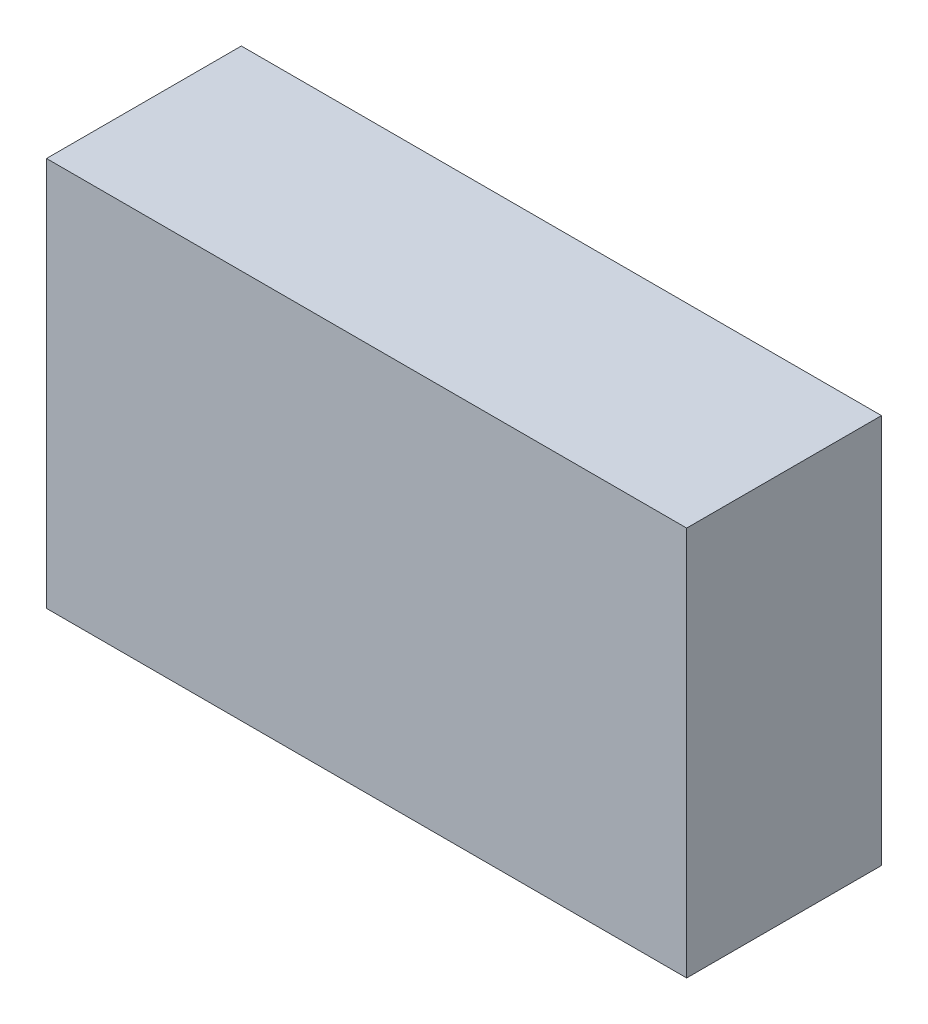
ISO-10303-21;
HEADER;
FILE_DESCRIPTION(('STEP AP214'),'2;1');
FILE_NAME('part.step','',(''),(''),'','','');
FILE_SCHEMA(('AUTOMOTIVE_DESIGN { 1 0 10303 214 1 1 1 1 }'));
ENDSEC;
DATA;
#1=APPLICATION_CONTEXT('core data for automotive mechanical design processes');
#2=APPLICATION_PROTOCOL_DEFINITION('international standard','automotive_design',2000,#1);
#3=PRODUCT_CONTEXT('',#1,'mechanical');
#4=PRODUCT('Part','Part','',(#3));
#5=PRODUCT_RELATED_PRODUCT_CATEGORY('part','',(#4));
#6=PRODUCT_DEFINITION_FORMATION('','',#4);
#7=PRODUCT_DEFINITION_CONTEXT('part definition',#1,'design');
#8=PRODUCT_DEFINITION('design','',#6,#7);
#9=PRODUCT_DEFINITION_SHAPE('','',#8);
#10=(LENGTH_UNIT() NAMED_UNIT(*) SI_UNIT(.MILLI.,.METRE.));
#11=(NAMED_UNIT(*) PLANE_ANGLE_UNIT() SI_UNIT($,.RADIAN.));
#12=(NAMED_UNIT(*) SI_UNIT($,.STERADIAN.) SOLID_ANGLE_UNIT());
#13=UNCERTAINTY_MEASURE_WITH_UNIT(LENGTH_MEASURE(1.E-05),#10,'distance_accuracy_value','');
#14=(GEOMETRIC_REPRESENTATION_CONTEXT(3) GLOBAL_UNCERTAINTY_ASSIGNED_CONTEXT((#13)) GLOBAL_UNIT_ASSIGNED_CONTEXT((#10,
#11,#12)) REPRESENTATION_CONTEXT('',''));
#15=CARTESIAN_POINT('',(0.,0.,0.));
#16=DIRECTION('',(0.,0.,1.));
#17=DIRECTION('',(1.,0.,0.));
#18=AXIS2_PLACEMENT_3D('',#15,#16,#17);
#19=CARTESIAN_POINT('',(-2.30000048,1.39999974,1.39999974));
#20=DIRECTION('',(0.,0.,-1.));
#21=DIRECTION('',(-1.,0.,0.));
#22=AXIS2_PLACEMENT_3D('',#19,#20,#21);
#23=PLANE('',#22);
#24=DIRECTION('',(1.,0.,0.));
#25=VECTOR('',#24,1.);
#26=CARTESIAN_POINT('',(-2.30000048,-1.39999974,1.39999974));
#27=LINE('',#26,#25);
#28=CARTESIAN_POINT('',(-2.30000048,-1.39999974,1.39999974));
#29=VERTEX_POINT('',#28);
#30=CARTESIAN_POINT('',(2.30000048,-1.39999974,1.39999974));
#31=VERTEX_POINT('',#30);
#32=EDGE_CURVE('E54',#29,#31,#27,.T.);
#33=ORIENTED_EDGE('',*,*,#32,.T.);
#34=DIRECTION('',(0.,1.,0.));
#35=VECTOR('',#34,1.);
#36=CARTESIAN_POINT('',(2.30000048,-1.39999974,1.39999974));
#37=LINE('',#36,#35);
#38=CARTESIAN_POINT('',(2.30000048,1.39999974,1.39999974));
#39=VERTEX_POINT('',#38);
#40=EDGE_CURVE('E56',#31,#39,#37,.T.);
#41=ORIENTED_EDGE('',*,*,#40,.T.);
#42=DIRECTION('',(1.,0.,0.));
#43=VECTOR('',#42,1.);
#44=CARTESIAN_POINT('',(2.30000048,1.39999974,1.39999974));
#45=LINE('',#44,#43);
#46=CARTESIAN_POINT('',(-2.30000048,1.39999974,1.39999974));
#47=VERTEX_POINT('',#46);
#48=EDGE_CURVE('E19',#39,#47,#45,.F.);
#49=ORIENTED_EDGE('',*,*,#48,.T.);
#50=DIRECTION('',(0.,1.,0.));
#51=VECTOR('',#50,1.);
#52=CARTESIAN_POINT('',(-2.30000048,1.39999974,1.39999974));
#53=LINE('',#52,#51);
#54=EDGE_CURVE('E79',#47,#29,#53,.F.);
#55=ORIENTED_EDGE('',*,*,#54,.T.);
#56=EDGE_LOOP('',(#33,#41,#49,#55));
#57=FACE_BOUND('',#56,.T.);
#58=ADVANCED_FACE('F16',(#57),#23,.F.);
#59=CARTESIAN_POINT('',(2.30000048,1.39999974,0.));
#60=DIRECTION('',(0.,-1.,0.));
#61=DIRECTION('',(0.,0.,-1.));
#62=AXIS2_PLACEMENT_3D('',#59,#60,#61);
#63=PLANE('',#62);
#64=DIRECTION('',(0.,0.,-1.));
#65=VECTOR('',#64,1.);
#66=CARTESIAN_POINT('',(-2.30000048,1.39999974,0.));
#67=LINE('',#66,#65);
#68=CARTESIAN_POINT('',(-2.30000048,1.39999974,0.));
#69=VERTEX_POINT('',#68);
#70=EDGE_CURVE('E67',#69,#47,#67,.F.);
#71=ORIENTED_EDGE('',*,*,#70,.T.);
#72=ORIENTED_EDGE('',*,*,#48,.F.);
#73=DIRECTION('',(0.,0.,1.));
#74=VECTOR('',#73,1.);
#75=CARTESIAN_POINT('',(2.30000048,1.39999974,0.));
#76=LINE('',#75,#74);
#77=CARTESIAN_POINT('',(2.30000048,1.39999974,0.));
#78=VERTEX_POINT('',#77);
#79=EDGE_CURVE('E62',#39,#78,#76,.F.);
#80=ORIENTED_EDGE('',*,*,#79,.T.);
#81=DIRECTION('',(-1.,0.,0.));
#82=VECTOR('',#81,1.);
#83=CARTESIAN_POINT('',(-2.30000048,1.39999974,0.));
#84=LINE('',#83,#82);
#85=EDGE_CURVE('E82',#69,#78,#84,.F.);
#86=ORIENTED_EDGE('',*,*,#85,.F.);
#87=EDGE_LOOP('',(#71,#72,#80,#86));
#88=FACE_BOUND('',#87,.T.);
#89=ADVANCED_FACE('F64',(#88),#63,.F.);
#90=CARTESIAN_POINT('',(2.30000048,-1.39999974,0.));
#91=DIRECTION('',(-1.,0.,0.));
#92=DIRECTION('',(0.,0.,1.));
#93=AXIS2_PLACEMENT_3D('',#90,#91,#92);
#94=PLANE('',#93);
#95=ORIENTED_EDGE('',*,*,#79,.F.);
#96=ORIENTED_EDGE('',*,*,#40,.F.);
#97=DIRECTION('',(0.,0.,1.));
#98=VECTOR('',#97,1.);
#99=CARTESIAN_POINT('',(2.30000048,-1.39999974,0.));
#100=LINE('',#99,#98);
#101=CARTESIAN_POINT('',(2.30000048,-1.39999974,0.));
#102=VERTEX_POINT('',#101);
#103=EDGE_CURVE('E74',#31,#102,#100,.F.);
#104=ORIENTED_EDGE('',*,*,#103,.T.);
#105=DIRECTION('',(0.,1.,0.));
#106=VECTOR('',#105,1.);
#107=CARTESIAN_POINT('',(2.30000048,1.39999974,0.));
#108=LINE('',#107,#106);
#109=EDGE_CURVE('E71',#78,#102,#108,.F.);
#110=ORIENTED_EDGE('',*,*,#109,.F.);
#111=EDGE_LOOP('',(#95,#96,#104,#110));
#112=FACE_BOUND('',#111,.T.);
#113=ADVANCED_FACE('F69',(#112),#94,.F.);
#114=CARTESIAN_POINT('',(-2.30000048,-1.39999974,0.));
#115=DIRECTION('',(0.,1.,0.));
#116=DIRECTION('',(0.,0.,1.));
#117=AXIS2_PLACEMENT_3D('',#114,#115,#116);
#118=PLANE('',#117);
#119=ORIENTED_EDGE('',*,*,#103,.F.);
#120=ORIENTED_EDGE('',*,*,#32,.F.);
#121=DIRECTION('',(0.,0.,-1.));
#122=VECTOR('',#121,1.);
#123=CARTESIAN_POINT('',(-2.30000048,-1.39999974,0.));
#124=LINE('',#123,#122);
#125=CARTESIAN_POINT('',(-2.30000048,-1.39999974,0.));
#126=VERTEX_POINT('',#125);
#127=EDGE_CURVE('E34',#29,#126,#124,.T.);
#128=ORIENTED_EDGE('',*,*,#127,.T.);
#129=DIRECTION('',(-1.,0.,0.));
#130=VECTOR('',#129,1.);
#131=CARTESIAN_POINT('',(-2.30000048,-1.39999974,0.));
#132=LINE('',#131,#130);
#133=EDGE_CURVE('E25',#102,#126,#132,.T.);
#134=ORIENTED_EDGE('',*,*,#133,.F.);
#135=EDGE_LOOP('',(#119,#120,#128,#134));
#136=FACE_BOUND('',#135,.T.);
#137=ADVANCED_FACE('F88',(#136),#118,.F.);
#138=CARTESIAN_POINT('',(-2.30000048,1.39999974,0.));
#139=DIRECTION('',(1.,0.,0.));
#140=DIRECTION('',(0.,0.,-1.));
#141=AXIS2_PLACEMENT_3D('',#138,#139,#140);
#142=PLANE('',#141);
#143=ORIENTED_EDGE('',*,*,#127,.F.);
#144=ORIENTED_EDGE('',*,*,#54,.F.);
#145=ORIENTED_EDGE('',*,*,#70,.F.);
#146=DIRECTION('',(0.,1.,0.));
#147=VECTOR('',#146,1.);
#148=CARTESIAN_POINT('',(-2.30000048,1.39999974,0.));
#149=LINE('',#148,#147);
#150=EDGE_CURVE('E11',#126,#69,#149,.T.);
#151=ORIENTED_EDGE('',*,*,#150,.F.);
#152=EDGE_LOOP('',(#143,#144,#145,#151));
#153=FACE_BOUND('',#152,.T.);
#154=ADVANCED_FACE('F90',(#153),#142,.F.);
#155=CARTESIAN_POINT('',(-2.30000048,1.39999974,0.));
#156=DIRECTION('',(0.,0.,-1.));
#157=DIRECTION('',(-1.,0.,0.));
#158=AXIS2_PLACEMENT_3D('',#155,#156,#157);
#159=PLANE('',#158);
#160=ORIENTED_EDGE('',*,*,#133,.T.);
#161=ORIENTED_EDGE('',*,*,#150,.T.);
#162=ORIENTED_EDGE('',*,*,#85,.T.);
#163=ORIENTED_EDGE('',*,*,#109,.T.);
#164=EDGE_LOOP('',(#160,#161,#162,#163));
#165=FACE_BOUND('',#164,.T.);
#166=ADVANCED_FACE('F87',(#165),#159,.T.);
#167=CLOSED_SHELL('',(#58,#89,#113,#137,#154,#166));
#168=MANIFOLD_SOLID_BREP('B1',#167);
#169=ADVANCED_BREP_SHAPE_REPRESENTATION('',(#18,#168),#14);
#170=SHAPE_DEFINITION_REPRESENTATION(#9,#169);
ENDSEC;
END-ISO-10303-21;
